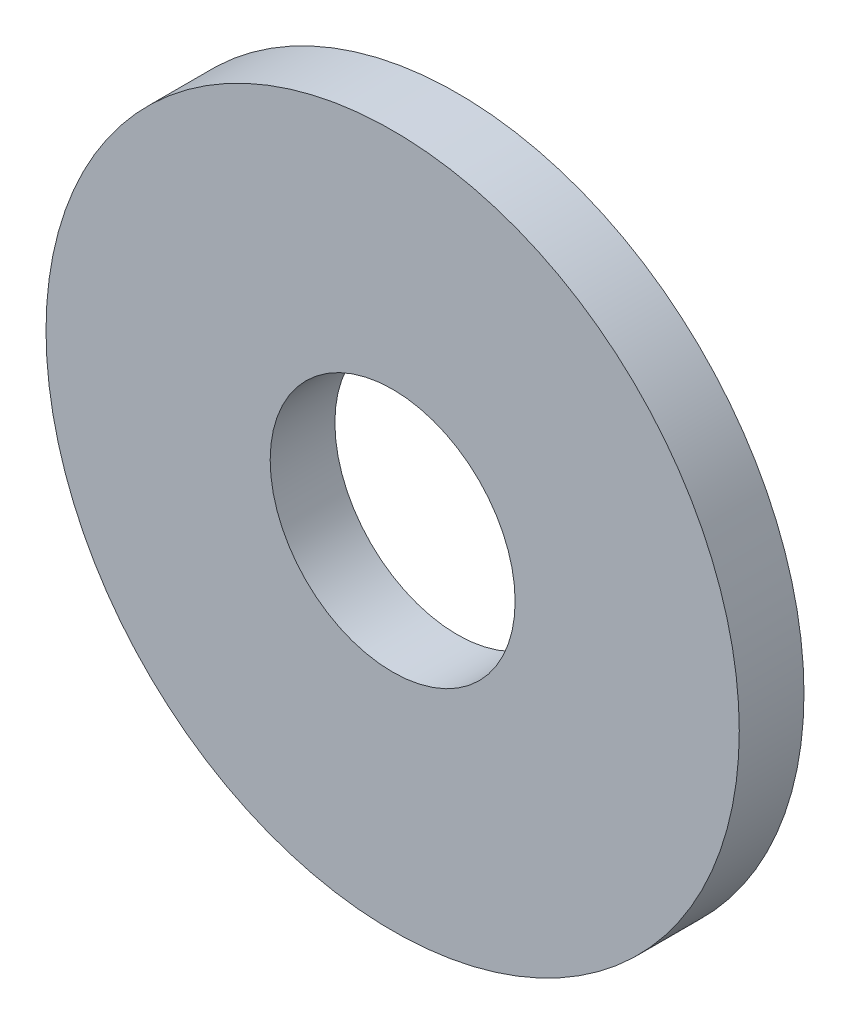
ISO-10303-21;
HEADER;
FILE_DESCRIPTION(('STEP AP214'),'2;1');
FILE_NAME('part.step','',(''),(''),'','','');
FILE_SCHEMA(('AUTOMOTIVE_DESIGN { 1 0 10303 214 1 1 1 1 }'));
ENDSEC;
DATA;
#1=APPLICATION_CONTEXT('core data for automotive mechanical design processes');
#2=APPLICATION_PROTOCOL_DEFINITION('international standard','automotive_design',2000,#1);
#3=PRODUCT_CONTEXT('',#1,'mechanical');
#4=PRODUCT('Part','Part','',(#3));
#5=PRODUCT_RELATED_PRODUCT_CATEGORY('part','',(#4));
#6=PRODUCT_DEFINITION_FORMATION('','',#4);
#7=PRODUCT_DEFINITION_CONTEXT('part definition',#1,'design');
#8=PRODUCT_DEFINITION('design','',#6,#7);
#9=PRODUCT_DEFINITION_SHAPE('','',#8);
#10=(LENGTH_UNIT() NAMED_UNIT(*) SI_UNIT(.MILLI.,.METRE.));
#11=(NAMED_UNIT(*) PLANE_ANGLE_UNIT() SI_UNIT($,.RADIAN.));
#12=(NAMED_UNIT(*) SI_UNIT($,.STERADIAN.) SOLID_ANGLE_UNIT());
#13=UNCERTAINTY_MEASURE_WITH_UNIT(LENGTH_MEASURE(1.E-05),#10,'distance_accuracy_value','');
#14=(GEOMETRIC_REPRESENTATION_CONTEXT(3) GLOBAL_UNCERTAINTY_ASSIGNED_CONTEXT((#13)) GLOBAL_UNIT_ASSIGNED_CONTEXT((#10,
#11,#12)) REPRESENTATION_CONTEXT('',''));
#15=CARTESIAN_POINT('',(0.,0.,0.));
#16=DIRECTION('',(0.,0.,1.));
#17=DIRECTION('',(1.,0.,0.));
#18=AXIS2_PLACEMENT_3D('',#15,#16,#17);
#19=CARTESIAN_POINT('',(0.,0.,1.40000000000001));
#20=DIRECTION('',(0.,0.,1.));
#21=DIRECTION('',(1.,0.,0.));
#22=AXIS2_PLACEMENT_3D('',#19,#20,#21);
#23=PLANE('',#22);
#24=CARTESIAN_POINT('',(0.,0.,1.40000000000001));
#25=DIRECTION('',(0.,0.,1.));
#26=DIRECTION('',(1.,0.,0.));
#27=AXIS2_PLACEMENT_3D('',#24,#25,#26);
#28=CIRCLE('',#27,7.5);
#29=CARTESIAN_POINT('',(7.5,0.,1.40000000000001));
#30=VERTEX_POINT('',#29);
#31=EDGE_CURVE('E12',#30,#30,#28,.T.);
#32=ORIENTED_EDGE('',*,*,#31,.T.);
#33=EDGE_LOOP('',(#32));
#34=FACE_BOUND('',#33,.T.);
#35=CARTESIAN_POINT('',(0.,0.,1.40000000000001));
#36=DIRECTION('',(0.,0.,1.));
#37=DIRECTION('',(1.,0.,0.));
#38=AXIS2_PLACEMENT_3D('',#35,#36,#37);
#39=CIRCLE('',#38,2.65);
#40=CARTESIAN_POINT('',(2.65,0.,1.40000000000001));
#41=VERTEX_POINT('',#40);
#42=EDGE_CURVE('E49',#41,#41,#39,.T.);
#43=ORIENTED_EDGE('',*,*,#42,.F.);
#44=EDGE_LOOP('',(#43));
#45=FACE_BOUND('',#44,.T.);
#46=ADVANCED_FACE('F38',(#34,#45),#23,.T.);
#47=CARTESIAN_POINT('',(0.,0.,0.));
#48=DIRECTION('',(0.,0.,1.));
#49=DIRECTION('',(1.,0.,0.));
#50=AXIS2_PLACEMENT_3D('',#47,#48,#49);
#51=PLANE('',#50);
#52=CARTESIAN_POINT('',(0.,0.,0.));
#53=DIRECTION('',(0.,0.,1.));
#54=DIRECTION('',(1.,0.,0.));
#55=AXIS2_PLACEMENT_3D('',#52,#53,#54);
#56=CIRCLE('',#55,7.5);
#57=CARTESIAN_POINT('',(7.5,0.,0.));
#58=VERTEX_POINT('',#57);
#59=EDGE_CURVE('E42',#58,#58,#56,.T.);
#60=ORIENTED_EDGE('',*,*,#59,.F.);
#61=EDGE_LOOP('',(#60));
#62=FACE_BOUND('',#61,.T.);
#63=CARTESIAN_POINT('',(0.,0.,0.));
#64=DIRECTION('',(0.,0.,1.));
#65=DIRECTION('',(1.,0.,0.));
#66=AXIS2_PLACEMENT_3D('',#63,#64,#65);
#67=CIRCLE('',#66,2.65);
#68=CARTESIAN_POINT('',(2.65,0.,0.));
#69=VERTEX_POINT('',#68);
#70=EDGE_CURVE('E51',#69,#69,#67,.T.);
#71=ORIENTED_EDGE('',*,*,#70,.T.);
#72=EDGE_LOOP('',(#71));
#73=FACE_BOUND('',#72,.T.);
#74=ADVANCED_FACE('F61',(#62,#73),#51,.F.);
#75=CARTESIAN_POINT('',(0.,0.,1.40000000000001));
#76=DIRECTION('',(0.,0.,-1.));
#77=DIRECTION('',(-1.,0.,0.));
#78=AXIS2_PLACEMENT_3D('',#75,#76,#77);
#79=CYLINDRICAL_SURFACE('',#78,7.5);
#80=ORIENTED_EDGE('',*,*,#31,.F.);
#81=EDGE_LOOP('',(#80));
#82=FACE_BOUND('',#81,.T.);
#83=ORIENTED_EDGE('',*,*,#59,.T.);
#84=EDGE_LOOP('',(#83));
#85=FACE_BOUND('',#84,.T.);
#86=ADVANCED_FACE('F40',(#82,#85),#79,.T.);
#87=CARTESIAN_POINT('',(0.,0.,1.40000000000001));
#88=DIRECTION('',(0.,0.,-1.));
#89=DIRECTION('',(-1.,0.,0.));
#90=AXIS2_PLACEMENT_3D('',#87,#88,#89);
#91=CYLINDRICAL_SURFACE('',#90,2.65);
#92=ORIENTED_EDGE('',*,*,#42,.T.);
#93=EDGE_LOOP('',(#92));
#94=FACE_BOUND('',#93,.T.);
#95=ORIENTED_EDGE('',*,*,#70,.F.);
#96=EDGE_LOOP('',(#95));
#97=FACE_BOUND('',#96,.T.);
#98=ADVANCED_FACE('F57',(#94,#97),#91,.F.);
#99=CLOSED_SHELL('',(#46,#74,#86,#98));
#100=MANIFOLD_SOLID_BREP('B2',#99);
#101=ADVANCED_BREP_SHAPE_REPRESENTATION('',(#18,#100),#14);
#102=SHAPE_DEFINITION_REPRESENTATION(#9,#101);
ENDSEC;
END-ISO-10303-21;
